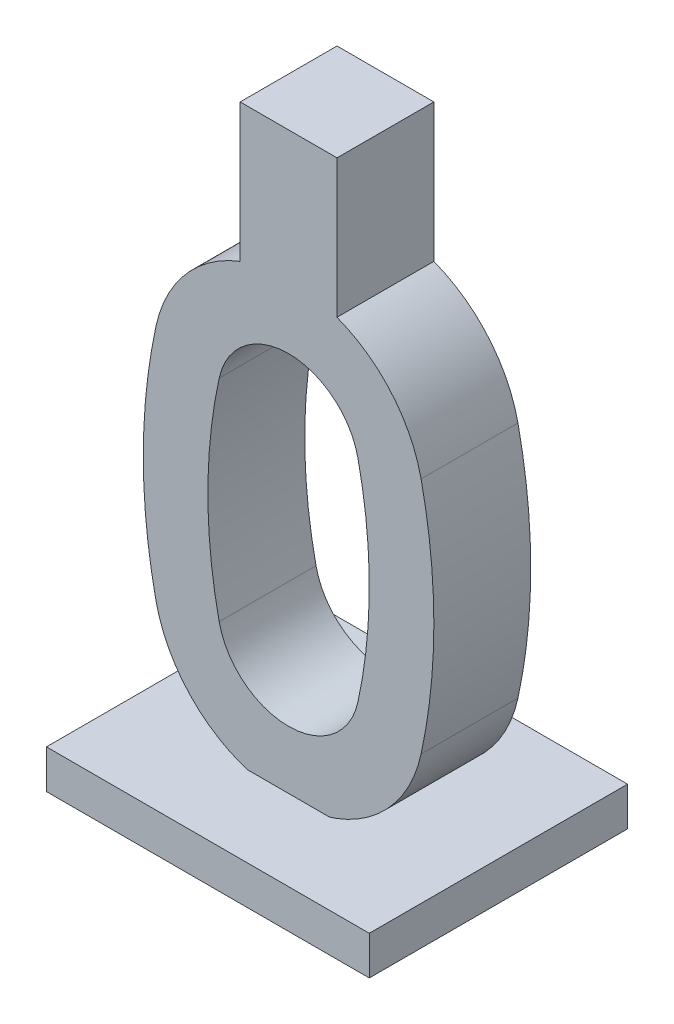
ISO-10303-21;
HEADER;
FILE_DESCRIPTION(('STEP AP214'),'2;1');
FILE_NAME('part.step','',(''),(''),'','','');
FILE_SCHEMA(('AUTOMOTIVE_DESIGN { 1 0 10303 214 1 1 1 1 }'));
ENDSEC;
DATA;
#1=APPLICATION_CONTEXT('core data for automotive mechanical design processes');
#2=APPLICATION_PROTOCOL_DEFINITION('international standard','automotive_design',2000,#1);
#3=PRODUCT_CONTEXT('',#1,'mechanical');
#4=PRODUCT('Part','Part','',(#3));
#5=PRODUCT_RELATED_PRODUCT_CATEGORY('part','',(#4));
#6=PRODUCT_DEFINITION_FORMATION('','',#4);
#7=PRODUCT_DEFINITION_CONTEXT('part definition',#1,'design');
#8=PRODUCT_DEFINITION('design','',#6,#7);
#9=PRODUCT_DEFINITION_SHAPE('','',#8);
#10=(LENGTH_UNIT() NAMED_UNIT(*) SI_UNIT(.MILLI.,.METRE.));
#11=(NAMED_UNIT(*) PLANE_ANGLE_UNIT() SI_UNIT($,.RADIAN.));
#12=(NAMED_UNIT(*) SI_UNIT($,.STERADIAN.) SOLID_ANGLE_UNIT());
#13=UNCERTAINTY_MEASURE_WITH_UNIT(LENGTH_MEASURE(1.E-05),#10,'distance_accuracy_value','');
#14=(GEOMETRIC_REPRESENTATION_CONTEXT(3) GLOBAL_UNCERTAINTY_ASSIGNED_CONTEXT((#13)) GLOBAL_UNIT_ASSIGNED_CONTEXT((#10,
#11,#12)) REPRESENTATION_CONTEXT('',''));
#15=CARTESIAN_POINT('',(0.,0.,0.));
#16=DIRECTION('',(0.,0.,1.));
#17=DIRECTION('',(1.,0.,0.));
#18=AXIS2_PLACEMENT_3D('',#15,#16,#17);
#19=CARTESIAN_POINT('',(-25.,-34.,27.5));
#20=DIRECTION('',(1.,0.,0.));
#21=DIRECTION('',(0.,0.,-1.));
#22=AXIS2_PLACEMENT_3D('',#19,#20,#21);
#23=PLANE('',#22);
#24=DIRECTION('',(0.,-1.,0.));
#25=VECTOR('',#24,1.);
#26=CARTESIAN_POINT('',(-25.,-34.,-12.5));
#27=LINE('',#26,#25);
#28=CARTESIAN_POINT('',(-25.,-34.,-12.5));
#29=VERTEX_POINT('',#28);
#30=CARTESIAN_POINT('',(-25.,-40.,-12.5));
#31=VERTEX_POINT('',#30);
#32=EDGE_CURVE('E103',#29,#31,#27,.T.);
#33=ORIENTED_EDGE('',*,*,#32,.T.);
#34=DIRECTION('',(0.,0.,1.));
#35=VECTOR('',#34,1.);
#36=CARTESIAN_POINT('',(-25.,-40.,27.5));
#37=LINE('',#36,#35);
#38=CARTESIAN_POINT('',(-25.,-40.,27.5));
#39=VERTEX_POINT('',#38);
#40=EDGE_CURVE('E98',#31,#39,#37,.T.);
#41=ORIENTED_EDGE('',*,*,#40,.T.);
#42=DIRECTION('',(0.,-1.,0.));
#43=VECTOR('',#42,1.);
#44=CARTESIAN_POINT('',(-25.,-34.,27.5));
#45=LINE('',#44,#43);
#46=CARTESIAN_POINT('',(-25.,-34.,27.5));
#47=VERTEX_POINT('',#46);
#48=EDGE_CURVE('E12',#47,#39,#45,.T.);
#49=ORIENTED_EDGE('',*,*,#48,.F.);
#50=DIRECTION('',(0.,0.,1.));
#51=VECTOR('',#50,1.);
#52=CARTESIAN_POINT('',(-25.,-34.,27.5));
#53=LINE('',#52,#51);
#54=EDGE_CURVE('E109',#29,#47,#53,.T.);
#55=ORIENTED_EDGE('',*,*,#54,.F.);
#56=EDGE_LOOP('',(#33,#41,#49,#55));
#57=FACE_BOUND('',#56,.T.);
#58=ADVANCED_FACE('F46',(#57),#23,.F.);
#59=CARTESIAN_POINT('',(-25.,-34.,27.5));
#60=DIRECTION('',(0.,0.,-1.));
#61=DIRECTION('',(-1.,0.,0.));
#62=AXIS2_PLACEMENT_3D('',#59,#60,#61);
#63=PLANE('',#62);
#64=ORIENTED_EDGE('',*,*,#48,.T.);
#65=DIRECTION('',(1.,0.,0.));
#66=VECTOR('',#65,1.);
#67=CARTESIAN_POINT('',(-25.,-40.,27.5));
#68=LINE('',#67,#66);
#69=CARTESIAN_POINT('',(25.,-40.,27.5));
#70=VERTEX_POINT('',#69);
#71=EDGE_CURVE('E88',#39,#70,#68,.T.);
#72=ORIENTED_EDGE('',*,*,#71,.T.);
#73=DIRECTION('',(0.,-1.,0.));
#74=VECTOR('',#73,1.);
#75=CARTESIAN_POINT('',(25.,-34.,27.5));
#76=LINE('',#75,#74);
#77=CARTESIAN_POINT('',(25.,-34.,27.5));
#78=VERTEX_POINT('',#77);
#79=EDGE_CURVE('E53',#78,#70,#76,.T.);
#80=ORIENTED_EDGE('',*,*,#79,.F.);
#81=DIRECTION('',(1.,0.,0.));
#82=VECTOR('',#81,1.);
#83=CARTESIAN_POINT('',(-25.,-34.,27.5));
#84=LINE('',#83,#82);
#85=EDGE_CURVE('E89',#47,#78,#84,.T.);
#86=ORIENTED_EDGE('',*,*,#85,.F.);
#87=EDGE_LOOP('',(#64,#72,#80,#86));
#88=FACE_BOUND('',#87,.T.);
#89=ADVANCED_FACE('F86',(#88),#63,.F.);
#90=CARTESIAN_POINT('',(25.,-34.,27.5));
#91=DIRECTION('',(-1.,0.,0.));
#92=DIRECTION('',(0.,0.,1.));
#93=AXIS2_PLACEMENT_3D('',#90,#91,#92);
#94=PLANE('',#93);
#95=ORIENTED_EDGE('',*,*,#79,.T.);
#96=DIRECTION('',(0.,0.,-1.));
#97=VECTOR('',#96,1.);
#98=CARTESIAN_POINT('',(25.,-40.,27.5));
#99=LINE('',#98,#97);
#100=CARTESIAN_POINT('',(25.,-40.,-12.5));
#101=VERTEX_POINT('',#100);
#102=EDGE_CURVE('E101',#70,#101,#99,.T.);
#103=ORIENTED_EDGE('',*,*,#102,.T.);
#104=DIRECTION('',(0.,-1.,0.));
#105=VECTOR('',#104,1.);
#106=CARTESIAN_POINT('',(25.,-34.,-12.5));
#107=LINE('',#106,#105);
#108=CARTESIAN_POINT('',(25.,-34.,-12.5));
#109=VERTEX_POINT('',#108);
#110=EDGE_CURVE('E115',#109,#101,#107,.T.);
#111=ORIENTED_EDGE('',*,*,#110,.F.);
#112=DIRECTION('',(0.,0.,-1.));
#113=VECTOR('',#112,1.);
#114=CARTESIAN_POINT('',(25.,-34.,27.5));
#115=LINE('',#114,#113);
#116=EDGE_CURVE('E65',#78,#109,#115,.T.);
#117=ORIENTED_EDGE('',*,*,#116,.F.);
#118=EDGE_LOOP('',(#95,#103,#111,#117));
#119=FACE_BOUND('',#118,.T.);
#120=ADVANCED_FACE('F117',(#119),#94,.F.);
#121=CARTESIAN_POINT('',(-25.,-34.,-12.5));
#122=DIRECTION('',(0.,0.,1.));
#123=DIRECTION('',(1.,0.,0.));
#124=AXIS2_PLACEMENT_3D('',#121,#122,#123);
#125=PLANE('',#124);
#126=ORIENTED_EDGE('',*,*,#110,.T.);
#127=DIRECTION('',(-1.,0.,0.));
#128=VECTOR('',#127,1.);
#129=CARTESIAN_POINT('',(-25.,-40.,-12.5));
#130=LINE('',#129,#128);
#131=EDGE_CURVE('E107',#101,#31,#130,.T.);
#132=ORIENTED_EDGE('',*,*,#131,.T.);
#133=ORIENTED_EDGE('',*,*,#32,.F.);
#134=DIRECTION('',(-1.,0.,0.));
#135=VECTOR('',#134,1.);
#136=CARTESIAN_POINT('',(-25.,-34.,-12.5));
#137=LINE('',#136,#135);
#138=EDGE_CURVE('E60',#109,#29,#137,.T.);
#139=ORIENTED_EDGE('',*,*,#138,.F.);
#140=EDGE_LOOP('',(#126,#132,#133,#139));
#141=FACE_BOUND('',#140,.T.);
#142=ADVANCED_FACE('F119',(#141),#125,.F.);
#143=CARTESIAN_POINT('',(0.,-34.,0.));
#144=DIRECTION('',(0.,-1.,0.));
#145=DIRECTION('',(0.,0.,-1.));
#146=AXIS2_PLACEMENT_3D('',#143,#144,#145);
#147=PLANE('',#146);
#148=ORIENTED_EDGE('',*,*,#54,.T.);
#149=ORIENTED_EDGE('',*,*,#85,.T.);
#150=ORIENTED_EDGE('',*,*,#116,.T.);
#151=ORIENTED_EDGE('',*,*,#138,.T.);
#152=EDGE_LOOP('',(#148,#149,#150,#151));
#153=FACE_BOUND('',#152,.T.);
#154=ADVANCED_FACE('F120',(#153),#147,.F.);
#155=CARTESIAN_POINT('',(0.,-40.,0.));
#156=DIRECTION('',(0.,-1.,0.));
#157=DIRECTION('',(0.,0.,-1.));
#158=AXIS2_PLACEMENT_3D('',#155,#156,#157);
#159=PLANE('',#158);
#160=ORIENTED_EDGE('',*,*,#40,.F.);
#161=ORIENTED_EDGE('',*,*,#131,.F.);
#162=ORIENTED_EDGE('',*,*,#102,.F.);
#163=ORIENTED_EDGE('',*,*,#71,.F.);
#164=EDGE_LOOP('',(#160,#161,#162,#163));
#165=FACE_BOUND('',#164,.T.);
#166=ADVANCED_FACE('F96',(#165),#159,.T.);
#167=CLOSED_SHELL('',(#58,#89,#120,#142,#154,#166));
#168=MANIFOLD_SOLID_BREP('B2',#167);
#169=CARTESIAN_POINT('',(0.,14.,15.));
#170=DIRECTION('',(0.,0.,-1.));
#171=DIRECTION('',(-1.,0.,0.));
#172=AXIS2_PLACEMENT_3D('',#169,#170,#171);
#173=CYLINDRICAL_SURFACE('',#172,21.);
#174=CARTESIAN_POINT('',(0.,14.,15.));
#175=DIRECTION('',(0.,0.,1.));
#176=DIRECTION('',(1.,0.,0.));
#177=AXIS2_PLACEMENT_3D('',#174,#175,#176);
#178=CIRCLE('',#177,21.);
#179=CARTESIAN_POINT('',(-7.49999999999999,33.615045245933,15.));
#180=VERTEX_POINT('',#179);
#181=CARTESIAN_POINT('',(-20.5233291298865,18.4489281210592,15.));
#182=VERTEX_POINT('',#181);
#183=EDGE_CURVE('E275',#180,#182,#178,.T.);
#184=ORIENTED_EDGE('',*,*,#183,.F.);
#185=DIRECTION('',(0.,0.,1.));
#186=VECTOR('',#185,1.);
#187=CARTESIAN_POINT('',(-7.5,33.615045245933,0.));
#188=LINE('',#187,#186);
#189=CARTESIAN_POINT('',(-7.5,33.615045245933,0.));
#190=VERTEX_POINT('',#189);
#191=EDGE_CURVE('E261',#190,#180,#188,.T.);
#192=ORIENTED_EDGE('',*,*,#191,.F.);
#193=CARTESIAN_POINT('',(0.,14.,0.));
#194=DIRECTION('',(0.,0.,1.));
#195=DIRECTION('',(1.,0.,0.));
#196=AXIS2_PLACEMENT_3D('',#193,#194,#195);
#197=CIRCLE('',#196,21.);
#198=CARTESIAN_POINT('',(-20.5233291298865,18.4489281210592,0.));
#199=VERTEX_POINT('',#198);
#200=EDGE_CURVE('E273',#190,#199,#197,.T.);
#201=ORIENTED_EDGE('',*,*,#200,.T.);
#202=DIRECTION('',(0.,0.,-1.));
#203=VECTOR('',#202,1.);
#204=CARTESIAN_POINT('',(-20.5233291298865,18.4489281210592,15.));
#205=LINE('',#204,#203);
#206=EDGE_CURVE('E177',#182,#199,#205,.T.);
#207=ORIENTED_EDGE('',*,*,#206,.F.);
#208=EDGE_LOOP('',(#184,#192,#201,#207));
#209=FACE_BOUND('',#208,.T.);
#210=ADVANCED_FACE('F169',(#209),#173,.T.);
#211=CARTESIAN_POINT('',(-32.2916666666671,-7.,15.));
#212=DIRECTION('',(0.,0.,-1.));
#213=DIRECTION('',(-1.,0.,0.));
#214=AXIS2_PLACEMENT_3D('',#211,#212,#213);
#215=PLANE('',#214);
#216=CARTESIAN_POINT('',(20.5233291298865,18.4489281210592,15.));
#217=VERTEX_POINT('',#216);
#218=CARTESIAN_POINT('',(7.5,33.615045245933,15.));
#219=VERTEX_POINT('',#218);
#220=EDGE_CURVE('E309',#217,#219,#178,.T.);
#221=ORIENTED_EDGE('',*,*,#220,.T.);
#222=DIRECTION('',(0.,1.,0.));
#223=VECTOR('',#222,1.);
#224=CARTESIAN_POINT('',(7.5,55.,15.));
#225=LINE('',#224,#223);
#226=CARTESIAN_POINT('',(7.5,55.,15.));
#227=VERTEX_POINT('',#226);
#228=EDGE_CURVE('E350',#219,#227,#225,.T.);
#229=ORIENTED_EDGE('',*,*,#228,.T.);
#230=DIRECTION('',(-1.,0.,0.));
#231=VECTOR('',#230,1.);
#232=CARTESIAN_POINT('',(-7.5,55.,15.));
#233=LINE('',#232,#231);
#234=CARTESIAN_POINT('',(-7.5,55.,15.));
#235=VERTEX_POINT('',#234);
#236=EDGE_CURVE('E269',#227,#235,#233,.T.);
#237=ORIENTED_EDGE('',*,*,#236,.T.);
#238=DIRECTION('',(0.,-1.,0.));
#239=VECTOR('',#238,1.);
#240=CARTESIAN_POINT('',(-7.5,55.,15.));
#241=LINE('',#240,#239);
#242=EDGE_CURVE('E184',#235,#180,#241,.T.);
#243=ORIENTED_EDGE('',*,*,#242,.T.);
#244=ORIENTED_EDGE('',*,*,#183,.T.);
#245=CARTESIAN_POINT('',(64.5833333333342,0.,15.));
#246=DIRECTION('',(0.,0.,1.));
#247=DIRECTION('',(1.,0.,0.));
#248=AXIS2_PLACEMENT_3D('',#245,#246,#247);
#249=CIRCLE('',#248,87.0833333333342);
#250=CARTESIAN_POINT('',(-20.5233291298865,-18.4489281210592,15.));
#251=VERTEX_POINT('',#250);
#252=EDGE_CURVE('E307',#182,#251,#249,.T.);
#253=ORIENTED_EDGE('',*,*,#252,.T.);
#254=CARTESIAN_POINT('',(0.,-14.,15.));
#255=DIRECTION('',(0.,0.,1.));
#256=DIRECTION('',(1.,0.,0.));
#257=AXIS2_PLACEMENT_3D('',#254,#255,#256);
#258=CIRCLE('',#257,21.);
#259=CARTESIAN_POINT('',(20.5233291298865,-18.4489281210592,15.));
#260=VERTEX_POINT('',#259);
#261=EDGE_CURVE('E301',#251,#260,#258,.T.);
#262=ORIENTED_EDGE('',*,*,#261,.T.);
#263=CARTESIAN_POINT('',(-64.5833333333342,0.,15.));
#264=DIRECTION('',(0.,0.,1.));
#265=DIRECTION('',(-1.,0.,0.));
#266=AXIS2_PLACEMENT_3D('',#263,#264,#265);
#267=CIRCLE('',#266,87.0833333333342);
#268=EDGE_CURVE('E296',#260,#217,#267,.T.);
#269=ORIENTED_EDGE('',*,*,#268,.T.);
#270=EDGE_LOOP('',(#221,#229,#237,#243,#244,#253,#262,#269));
#271=FACE_BOUND('',#270,.T.);
#272=CARTESIAN_POINT('',(64.5833333333342,0.,15.));
#273=DIRECTION('',(0.,0.,1.));
#274=DIRECTION('',(1.,0.,0.));
#275=AXIS2_PLACEMENT_3D('',#272,#273,#274);
#276=CIRCLE('',#275,77.0833333333341);
#277=CARTESIAN_POINT('',(-10.750315258512,16.3303909205548,15.));
#278=VERTEX_POINT('',#277);
#279=CARTESIAN_POINT('',(-10.750315258512,-16.3303909205548,15.));
#280=VERTEX_POINT('',#279);
#281=EDGE_CURVE('E328',#278,#280,#276,.T.);
#282=ORIENTED_EDGE('',*,*,#281,.F.);
#283=CARTESIAN_POINT('',(0.,14.,15.));
#284=DIRECTION('',(0.,0.,1.));
#285=DIRECTION('',(1.,0.,0.));
#286=AXIS2_PLACEMENT_3D('',#283,#284,#285);
#287=CIRCLE('',#286,11.);
#288=CARTESIAN_POINT('',(10.750315258512,16.3303909205548,15.));
#289=VERTEX_POINT('',#288);
#290=EDGE_CURVE('E324',#289,#278,#287,.T.);
#291=ORIENTED_EDGE('',*,*,#290,.F.);
#292=CARTESIAN_POINT('',(-64.5833333333342,0.,15.));
#293=DIRECTION('',(0.,0.,1.));
#294=DIRECTION('',(-1.,0.,0.));
#295=AXIS2_PLACEMENT_3D('',#292,#293,#294);
#296=CIRCLE('',#295,77.0833333333341);
#297=CARTESIAN_POINT('',(10.750315258512,-16.3303909205548,15.));
#298=VERTEX_POINT('',#297);
#299=EDGE_CURVE('E339',#298,#289,#296,.T.);
#300=ORIENTED_EDGE('',*,*,#299,.F.);
#301=CARTESIAN_POINT('',(0.,-14.,15.));
#302=DIRECTION('',(0.,0.,1.));
#303=DIRECTION('',(1.,0.,0.));
#304=AXIS2_PLACEMENT_3D('',#301,#302,#303);
#305=CIRCLE('',#304,11.);
#306=EDGE_CURVE('E341',#280,#298,#305,.T.);
#307=ORIENTED_EDGE('',*,*,#306,.F.);
#308=EDGE_LOOP('',(#282,#291,#300,#307));
#309=FACE_BOUND('',#308,.T.);
#310=ADVANCED_FACE('F362',(#271,#309),#215,.F.);
#311=CARTESIAN_POINT('',(-32.2916666666671,-7.,0.));
#312=DIRECTION('',(0.,0.,-1.));
#313=DIRECTION('',(-1.,0.,0.));
#314=AXIS2_PLACEMENT_3D('',#311,#312,#313);
#315=PLANE('',#314);
#316=ORIENTED_EDGE('',*,*,#200,.F.);
#317=DIRECTION('',(0.,-1.,0.));
#318=VECTOR('',#317,1.);
#319=CARTESIAN_POINT('',(-7.5,55.,0.));
#320=LINE('',#319,#318);
#321=CARTESIAN_POINT('',(-7.5,55.,0.));
#322=VERTEX_POINT('',#321);
#323=EDGE_CURVE('E258',#322,#190,#320,.T.);
#324=ORIENTED_EDGE('',*,*,#323,.F.);
#325=DIRECTION('',(-1.,0.,0.));
#326=VECTOR('',#325,1.);
#327=CARTESIAN_POINT('',(-7.5,55.,0.));
#328=LINE('',#327,#326);
#329=CARTESIAN_POINT('',(7.5,55.,0.));
#330=VERTEX_POINT('',#329);
#331=EDGE_CURVE('E277',#330,#322,#328,.T.);
#332=ORIENTED_EDGE('',*,*,#331,.F.);
#333=DIRECTION('',(0.,1.,0.));
#334=VECTOR('',#333,1.);
#335=CARTESIAN_POINT('',(7.5,55.,0.));
#336=LINE('',#335,#334);
#337=CARTESIAN_POINT('',(7.5,33.615045245933,0.));
#338=VERTEX_POINT('',#337);
#339=EDGE_CURVE('E268',#338,#330,#336,.T.);
#340=ORIENTED_EDGE('',*,*,#339,.F.);
#341=CARTESIAN_POINT('',(20.5233291298865,18.4489281210592,0.));
#342=VERTEX_POINT('',#341);
#343=EDGE_CURVE('E284',#342,#338,#197,.T.);
#344=ORIENTED_EDGE('',*,*,#343,.F.);
#345=CARTESIAN_POINT('',(-64.5833333333342,0.,0.));
#346=DIRECTION('',(0.,0.,1.));
#347=DIRECTION('',(-1.,0.,0.));
#348=AXIS2_PLACEMENT_3D('',#345,#346,#347);
#349=CIRCLE('',#348,87.0833333333342);
#350=CARTESIAN_POINT('',(20.5233291298865,-18.4489281210592,0.));
#351=VERTEX_POINT('',#350);
#352=EDGE_CURVE('E285',#351,#342,#349,.T.);
#353=ORIENTED_EDGE('',*,*,#352,.F.);
#354=CARTESIAN_POINT('',(0.,-14.,0.));
#355=DIRECTION('',(0.,0.,1.));
#356=DIRECTION('',(1.,0.,0.));
#357=AXIS2_PLACEMENT_3D('',#354,#355,#356);
#358=CIRCLE('',#357,21.);
#359=CARTESIAN_POINT('',(-20.5233291298865,-18.4489281210592,0.));
#360=VERTEX_POINT('',#359);
#361=EDGE_CURVE('E294',#360,#351,#358,.T.);
#362=ORIENTED_EDGE('',*,*,#361,.F.);
#363=CARTESIAN_POINT('',(64.5833333333342,0.,0.));
#364=DIRECTION('',(0.,0.,1.));
#365=DIRECTION('',(1.,0.,0.));
#366=AXIS2_PLACEMENT_3D('',#363,#364,#365);
#367=CIRCLE('',#366,87.0833333333342);
#368=EDGE_CURVE('E283',#199,#360,#367,.T.);
#369=ORIENTED_EDGE('',*,*,#368,.F.);
#370=EDGE_LOOP('',(#316,#324,#332,#340,#344,#353,#362,#369));
#371=FACE_BOUND('',#370,.T.);
#372=CARTESIAN_POINT('',(0.,14.,0.));
#373=DIRECTION('',(0.,0.,1.));
#374=DIRECTION('',(1.,0.,0.));
#375=AXIS2_PLACEMENT_3D('',#372,#373,#374);
#376=CIRCLE('',#375,11.);
#377=CARTESIAN_POINT('',(10.750315258512,16.3303909205548,0.));
#378=VERTEX_POINT('',#377);
#379=CARTESIAN_POINT('',(-10.750315258512,16.3303909205548,0.));
#380=VERTEX_POINT('',#379);
#381=EDGE_CURVE('E325',#378,#380,#376,.T.);
#382=ORIENTED_EDGE('',*,*,#381,.T.);
#383=CARTESIAN_POINT('',(64.5833333333342,0.,0.));
#384=DIRECTION('',(0.,0.,1.));
#385=DIRECTION('',(1.,0.,0.));
#386=AXIS2_PLACEMENT_3D('',#383,#384,#385);
#387=CIRCLE('',#386,77.0833333333341);
#388=CARTESIAN_POINT('',(-10.750315258512,-16.3303909205548,0.));
#389=VERTEX_POINT('',#388);
#390=EDGE_CURVE('E335',#380,#389,#387,.T.);
#391=ORIENTED_EDGE('',*,*,#390,.T.);
#392=CARTESIAN_POINT('',(0.,-14.,0.));
#393=DIRECTION('',(0.,0.,1.));
#394=DIRECTION('',(-1.,0.,0.));
#395=AXIS2_PLACEMENT_3D('',#392,#393,#394);
#396=CIRCLE('',#395,11.);
#397=CARTESIAN_POINT('',(10.750315258512,-16.3303909205548,0.));
#398=VERTEX_POINT('',#397);
#399=EDGE_CURVE('E332',#389,#398,#396,.T.);
#400=ORIENTED_EDGE('',*,*,#399,.T.);
#401=CARTESIAN_POINT('',(-64.5833333333342,0.,0.));
#402=DIRECTION('',(0.,0.,1.));
#403=DIRECTION('',(-1.,0.,0.));
#404=AXIS2_PLACEMENT_3D('',#401,#402,#403);
#405=CIRCLE('',#404,77.0833333333341);
#406=EDGE_CURVE('E329',#398,#378,#405,.T.);
#407=ORIENTED_EDGE('',*,*,#406,.T.);
#408=EDGE_LOOP('',(#382,#391,#400,#407));
#409=FACE_BOUND('',#408,.T.);
#410=ADVANCED_FACE('F280',(#371,#409),#315,.T.);
#411=CARTESIAN_POINT('',(-64.5833333333342,0.,15.));
#412=DIRECTION('',(0.,0.,-1.));
#413=DIRECTION('',(-1.,0.,0.));
#414=AXIS2_PLACEMENT_3D('',#411,#412,#413);
#415=CYLINDRICAL_SURFACE('',#414,87.0833333333342);
#416=ORIENTED_EDGE('',*,*,#352,.T.);
#417=DIRECTION('',(0.,0.,-1.));
#418=VECTOR('',#417,1.);
#419=CARTESIAN_POINT('',(20.5233291298865,18.4489281210592,15.));
#420=LINE('',#419,#418);
#421=EDGE_CURVE('E44',#217,#342,#420,.T.);
#422=ORIENTED_EDGE('',*,*,#421,.F.);
#423=ORIENTED_EDGE('',*,*,#268,.F.);
#424=DIRECTION('',(0.,0.,-1.));
#425=VECTOR('',#424,1.);
#426=CARTESIAN_POINT('',(20.5233291298865,-18.4489281210592,15.));
#427=LINE('',#426,#425);
#428=EDGE_CURVE('E297',#260,#351,#427,.T.);
#429=ORIENTED_EDGE('',*,*,#428,.T.);
#430=EDGE_LOOP('',(#416,#422,#423,#429));
#431=FACE_BOUND('',#430,.T.);
#432=ADVANCED_FACE('F171',(#431),#415,.T.);
#433=ORIENTED_EDGE('',*,*,#343,.T.);
#434=DIRECTION('',(0.,0.,1.));
#435=VECTOR('',#434,1.);
#436=CARTESIAN_POINT('',(7.5,33.615045245933,0.));
#437=LINE('',#436,#435);
#438=EDGE_CURVE('E276',#338,#219,#437,.T.);
#439=ORIENTED_EDGE('',*,*,#438,.T.);
#440=ORIENTED_EDGE('',*,*,#220,.F.);
#441=ORIENTED_EDGE('',*,*,#421,.T.);
#442=EDGE_LOOP('',(#433,#439,#440,#441));
#443=FACE_BOUND('',#442,.T.);
#444=ADVANCED_FACE('F365',(#443),#173,.T.);
#445=CARTESIAN_POINT('',(64.5833333333342,0.,15.));
#446=DIRECTION('',(0.,0.,-1.));
#447=DIRECTION('',(-1.,0.,0.));
#448=AXIS2_PLACEMENT_3D('',#445,#446,#447);
#449=CYLINDRICAL_SURFACE('',#448,87.0833333333342);
#450=ORIENTED_EDGE('',*,*,#368,.T.);
#451=DIRECTION('',(0.,0.,-1.));
#452=VECTOR('',#451,1.);
#453=CARTESIAN_POINT('',(-20.5233291298865,-18.4489281210592,15.));
#454=LINE('',#453,#452);
#455=EDGE_CURVE('E300',#251,#360,#454,.T.);
#456=ORIENTED_EDGE('',*,*,#455,.F.);
#457=ORIENTED_EDGE('',*,*,#252,.F.);
#458=ORIENTED_EDGE('',*,*,#206,.T.);
#459=EDGE_LOOP('',(#450,#456,#457,#458));
#460=FACE_BOUND('',#459,.T.);
#461=ADVANCED_FACE('F305',(#460),#449,.T.);
#462=CARTESIAN_POINT('',(0.,-14.,15.));
#463=DIRECTION('',(0.,0.,-1.));
#464=DIRECTION('',(-1.,0.,0.));
#465=AXIS2_PLACEMENT_3D('',#462,#463,#464);
#466=CYLINDRICAL_SURFACE('',#465,21.);
#467=ORIENTED_EDGE('',*,*,#361,.T.);
#468=ORIENTED_EDGE('',*,*,#428,.F.);
#469=ORIENTED_EDGE('',*,*,#261,.F.);
#470=ORIENTED_EDGE('',*,*,#455,.T.);
#471=EDGE_LOOP('',(#467,#468,#469,#470));
#472=FACE_BOUND('',#471,.T.);
#473=ADVANCED_FACE('F372',(#472),#466,.T.);
#474=CARTESIAN_POINT('',(64.5833333333342,0.,15.));
#475=DIRECTION('',(0.,0.,-1.));
#476=DIRECTION('',(-1.,0.,0.));
#477=AXIS2_PLACEMENT_3D('',#474,#475,#476);
#478=CYLINDRICAL_SURFACE('',#477,77.0833333333341);
#479=ORIENTED_EDGE('',*,*,#390,.F.);
#480=DIRECTION('',(0.,0.,-1.));
#481=VECTOR('',#480,1.);
#482=CARTESIAN_POINT('',(-10.750315258512,16.3303909205548,15.));
#483=LINE('',#482,#481);
#484=EDGE_CURVE('E321',#278,#380,#483,.T.);
#485=ORIENTED_EDGE('',*,*,#484,.F.);
#486=ORIENTED_EDGE('',*,*,#281,.T.);
#487=DIRECTION('',(0.,0.,-1.));
#488=VECTOR('',#487,1.);
#489=CARTESIAN_POINT('',(-10.750315258512,-16.3303909205548,15.));
#490=LINE('',#489,#488);
#491=EDGE_CURVE('E289',#280,#389,#490,.T.);
#492=ORIENTED_EDGE('',*,*,#491,.T.);
#493=EDGE_LOOP('',(#479,#485,#486,#492));
#494=FACE_BOUND('',#493,.T.);
#495=ADVANCED_FACE('F374',(#494),#478,.F.);
#496=CARTESIAN_POINT('',(0.,-14.,15.));
#497=DIRECTION('',(0.,0.,-1.));
#498=DIRECTION('',(-1.,0.,0.));
#499=AXIS2_PLACEMENT_3D('',#496,#497,#498);
#500=CYLINDRICAL_SURFACE('',#499,11.);
#501=ORIENTED_EDGE('',*,*,#399,.F.);
#502=ORIENTED_EDGE('',*,*,#491,.F.);
#503=ORIENTED_EDGE('',*,*,#306,.T.);
#504=DIRECTION('',(0.,0.,-1.));
#505=VECTOR('',#504,1.);
#506=CARTESIAN_POINT('',(10.750315258512,-16.3303909205548,15.));
#507=LINE('',#506,#505);
#508=EDGE_CURVE('E318',#298,#398,#507,.T.);
#509=ORIENTED_EDGE('',*,*,#508,.T.);
#510=EDGE_LOOP('',(#501,#502,#503,#509));
#511=FACE_BOUND('',#510,.T.);
#512=ADVANCED_FACE('F380',(#511),#500,.F.);
#513=CARTESIAN_POINT('',(-64.5833333333342,0.,15.));
#514=DIRECTION('',(0.,0.,-1.));
#515=DIRECTION('',(-1.,0.,0.));
#516=AXIS2_PLACEMENT_3D('',#513,#514,#515);
#517=CYLINDRICAL_SURFACE('',#516,77.0833333333341);
#518=ORIENTED_EDGE('',*,*,#406,.F.);
#519=ORIENTED_EDGE('',*,*,#508,.F.);
#520=ORIENTED_EDGE('',*,*,#299,.T.);
#521=DIRECTION('',(0.,0.,-1.));
#522=VECTOR('',#521,1.);
#523=CARTESIAN_POINT('',(10.750315258512,16.3303909205548,15.));
#524=LINE('',#523,#522);
#525=EDGE_CURVE('E192',#289,#378,#524,.T.);
#526=ORIENTED_EDGE('',*,*,#525,.T.);
#527=EDGE_LOOP('',(#518,#519,#520,#526));
#528=FACE_BOUND('',#527,.T.);
#529=ADVANCED_FACE('F402',(#528),#517,.F.);
#530=CARTESIAN_POINT('',(0.,14.,15.));
#531=DIRECTION('',(0.,0.,-1.));
#532=DIRECTION('',(-1.,0.,0.));
#533=AXIS2_PLACEMENT_3D('',#530,#531,#532);
#534=CYLINDRICAL_SURFACE('',#533,11.);
#535=ORIENTED_EDGE('',*,*,#381,.F.);
#536=ORIENTED_EDGE('',*,*,#525,.F.);
#537=ORIENTED_EDGE('',*,*,#290,.T.);
#538=ORIENTED_EDGE('',*,*,#484,.T.);
#539=EDGE_LOOP('',(#535,#536,#537,#538));
#540=FACE_BOUND('',#539,.T.);
#541=ADVANCED_FACE('F406',(#540),#534,.F.);
#542=CARTESIAN_POINT('',(-7.5,55.,0.));
#543=DIRECTION('',(-1.,0.,0.));
#544=DIRECTION('',(0.,-1.,0.));
#545=AXIS2_PLACEMENT_3D('',#542,#543,#544);
#546=PLANE('',#545);
#547=ORIENTED_EDGE('',*,*,#242,.F.);
#548=DIRECTION('',(0.,0.,1.));
#549=VECTOR('',#548,1.);
#550=CARTESIAN_POINT('',(-7.5,55.,0.));
#551=LINE('',#550,#549);
#552=EDGE_CURVE('E263',#322,#235,#551,.T.);
#553=ORIENTED_EDGE('',*,*,#552,.F.);
#554=ORIENTED_EDGE('',*,*,#323,.T.);
#555=ORIENTED_EDGE('',*,*,#191,.T.);
#556=EDGE_LOOP('',(#547,#553,#554,#555));
#557=FACE_BOUND('',#556,.T.);
#558=ADVANCED_FACE('F260',(#557),#546,.T.);
#559=CARTESIAN_POINT('',(-7.5,55.,0.));
#560=DIRECTION('',(0.,1.,0.));
#561=DIRECTION('',(0.,0.,1.));
#562=AXIS2_PLACEMENT_3D('',#559,#560,#561);
#563=PLANE('',#562);
#564=ORIENTED_EDGE('',*,*,#236,.F.);
#565=DIRECTION('',(0.,0.,1.));
#566=VECTOR('',#565,1.);
#567=CARTESIAN_POINT('',(7.5,55.,0.));
#568=LINE('',#567,#566);
#569=EDGE_CURVE('E346',#330,#227,#568,.T.);
#570=ORIENTED_EDGE('',*,*,#569,.F.);
#571=ORIENTED_EDGE('',*,*,#331,.T.);
#572=ORIENTED_EDGE('',*,*,#552,.T.);
#573=EDGE_LOOP('',(#564,#570,#571,#572));
#574=FACE_BOUND('',#573,.T.);
#575=ADVANCED_FACE('F361',(#574),#563,.T.);
#576=CARTESIAN_POINT('',(7.5,55.,0.));
#577=DIRECTION('',(1.,0.,0.));
#578=DIRECTION('',(0.,1.,0.));
#579=AXIS2_PLACEMENT_3D('',#576,#577,#578);
#580=PLANE('',#579);
#581=ORIENTED_EDGE('',*,*,#228,.F.);
#582=ORIENTED_EDGE('',*,*,#438,.F.);
#583=ORIENTED_EDGE('',*,*,#339,.T.);
#584=ORIENTED_EDGE('',*,*,#569,.T.);
#585=EDGE_LOOP('',(#581,#582,#583,#584));
#586=FACE_BOUND('',#585,.T.);
#587=ADVANCED_FACE('F358',(#586),#580,.T.);
#588=CLOSED_SHELL('',(#210,#310,#410,#432,#444,#461,#473,#495,#512,#529,#541,#558,#575,#587));
#589=MANIFOLD_SOLID_BREP('B6',#588);
#590=ADVANCED_BREP_SHAPE_REPRESENTATION('',(#18,#168,#589),#14);
#591=SHAPE_DEFINITION_REPRESENTATION(#9,#590);
ENDSEC;
END-ISO-10303-21;
